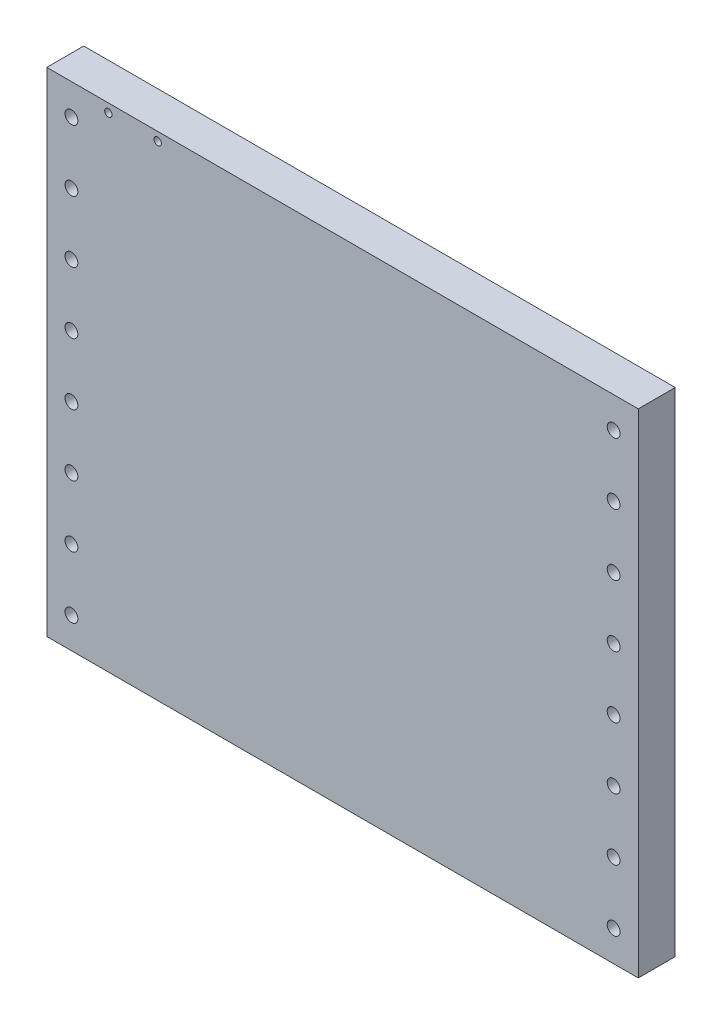
ISO-10303-21;
HEADER;
FILE_DESCRIPTION(('STEP AP214'),'2;1');
FILE_NAME('part.step','',(''),(''),'','','');
FILE_SCHEMA(('AUTOMOTIVE_DESIGN { 1 0 10303 214 1 1 1 1 }'));
ENDSEC;
DATA;
#1=APPLICATION_CONTEXT('core data for automotive mechanical design processes');
#2=APPLICATION_PROTOCOL_DEFINITION('international standard','automotive_design',2000,#1);
#3=PRODUCT_CONTEXT('',#1,'mechanical');
#4=PRODUCT('Part','Part','',(#3));
#5=PRODUCT_RELATED_PRODUCT_CATEGORY('part','',(#4));
#6=PRODUCT_DEFINITION_FORMATION('','',#4);
#7=PRODUCT_DEFINITION_CONTEXT('part definition',#1,'design');
#8=PRODUCT_DEFINITION('design','',#6,#7);
#9=PRODUCT_DEFINITION_SHAPE('','',#8);
#10=(LENGTH_UNIT() NAMED_UNIT(*) SI_UNIT(.MILLI.,.METRE.));
#11=(NAMED_UNIT(*) PLANE_ANGLE_UNIT() SI_UNIT($,.RADIAN.));
#12=(NAMED_UNIT(*) SI_UNIT($,.STERADIAN.) SOLID_ANGLE_UNIT());
#13=UNCERTAINTY_MEASURE_WITH_UNIT(LENGTH_MEASURE(1.E-05),#10,'distance_accuracy_value','');
#14=(GEOMETRIC_REPRESENTATION_CONTEXT(3) GLOBAL_UNCERTAINTY_ASSIGNED_CONTEXT((#13)) GLOBAL_UNIT_ASSIGNED_CONTEXT((#10,
#11,#12)) REPRESENTATION_CONTEXT('',''));
#15=CARTESIAN_POINT('',(0.,0.,0.));
#16=DIRECTION('',(0.,0.,1.));
#17=DIRECTION('',(1.,0.,0.));
#18=AXIS2_PLACEMENT_3D('',#15,#16,#17);
#19=CARTESIAN_POINT('',(120.,-100.,7.5));
#20=DIRECTION('',(-1.,0.,0.));
#21=DIRECTION('',(0.,0.,1.));
#22=AXIS2_PLACEMENT_3D('',#19,#20,#21);
#23=PLANE('',#22);
#24=DIRECTION('',(0.,1.,0.));
#25=VECTOR('',#24,1.);
#26=CARTESIAN_POINT('',(120.,-100.,-7.5));
#27=LINE('',#26,#25);
#28=CARTESIAN_POINT('',(120.,-100.,-7.5));
#29=VERTEX_POINT('',#28);
#30=CARTESIAN_POINT('',(120.,100.,-7.5));
#31=VERTEX_POINT('',#30);
#32=EDGE_CURVE('E101',#29,#31,#27,.T.);
#33=ORIENTED_EDGE('',*,*,#32,.T.);
#34=DIRECTION('',(0.,0.,-1.));
#35=VECTOR('',#34,1.);
#36=CARTESIAN_POINT('',(120.,100.,7.5));
#37=LINE('',#36,#35);
#38=CARTESIAN_POINT('',(120.,100.,7.5));
#39=VERTEX_POINT('',#38);
#40=EDGE_CURVE('E92',#39,#31,#37,.T.);
#41=ORIENTED_EDGE('',*,*,#40,.F.);
#42=DIRECTION('',(0.,1.,0.));
#43=VECTOR('',#42,1.);
#44=CARTESIAN_POINT('',(120.,-100.,7.5));
#45=LINE('',#44,#43);
#46=CARTESIAN_POINT('',(120.,-100.,7.5));
#47=VERTEX_POINT('',#46);
#48=EDGE_CURVE('E86',#47,#39,#45,.T.);
#49=ORIENTED_EDGE('',*,*,#48,.F.);
#50=DIRECTION('',(0.,0.,-1.));
#51=VECTOR('',#50,1.);
#52=CARTESIAN_POINT('',(120.,-100.,7.5));
#53=LINE('',#52,#51);
#54=EDGE_CURVE('E97',#47,#29,#53,.T.);
#55=ORIENTED_EDGE('',*,*,#54,.T.);
#56=EDGE_LOOP('',(#33,#41,#49,#55));
#57=FACE_BOUND('',#56,.T.);
#58=ADVANCED_FACE('F32',(#57),#23,.F.);
#59=CARTESIAN_POINT('',(-120.,100.,7.5));
#60=DIRECTION('',(0.,-1.,0.));
#61=DIRECTION('',(0.,0.,-1.));
#62=AXIS2_PLACEMENT_3D('',#59,#60,#61);
#63=PLANE('',#62);
#64=DIRECTION('',(-1.,0.,0.));
#65=VECTOR('',#64,1.);
#66=CARTESIAN_POINT('',(-120.,100.,-7.5));
#67=LINE('',#66,#65);
#68=CARTESIAN_POINT('',(-120.,100.,-7.5));
#69=VERTEX_POINT('',#68);
#70=EDGE_CURVE('E91',#31,#69,#67,.T.);
#71=ORIENTED_EDGE('',*,*,#70,.T.);
#72=DIRECTION('',(0.,0.,-1.));
#73=VECTOR('',#72,1.);
#74=CARTESIAN_POINT('',(-120.,100.,7.5));
#75=LINE('',#74,#73);
#76=CARTESIAN_POINT('',(-120.,100.,7.5));
#77=VERTEX_POINT('',#76);
#78=EDGE_CURVE('E89',#77,#69,#75,.T.);
#79=ORIENTED_EDGE('',*,*,#78,.F.);
#80=DIRECTION('',(-1.,0.,0.));
#81=VECTOR('',#80,1.);
#82=CARTESIAN_POINT('',(-120.,100.,7.5));
#83=LINE('',#82,#81);
#84=EDGE_CURVE('E80',#39,#77,#83,.T.);
#85=ORIENTED_EDGE('',*,*,#84,.F.);
#86=ORIENTED_EDGE('',*,*,#40,.T.);
#87=EDGE_LOOP('',(#71,#79,#85,#86));
#88=FACE_BOUND('',#87,.T.);
#89=ADVANCED_FACE('F90',(#88),#63,.F.);
#90=CARTESIAN_POINT('',(-120.,-100.,7.5));
#91=DIRECTION('',(1.,0.,0.));
#92=DIRECTION('',(0.,0.,-1.));
#93=AXIS2_PLACEMENT_3D('',#90,#91,#92);
#94=PLANE('',#93);
#95=DIRECTION('',(0.,-1.,0.));
#96=VECTOR('',#95,1.);
#97=CARTESIAN_POINT('',(-120.,-100.,-7.5));
#98=LINE('',#97,#96);
#99=CARTESIAN_POINT('',(-120.,-100.,-7.5));
#100=VERTEX_POINT('',#99);
#101=EDGE_CURVE('E66',#69,#100,#98,.T.);
#102=ORIENTED_EDGE('',*,*,#101,.T.);
#103=DIRECTION('',(0.,0.,-1.));
#104=VECTOR('',#103,1.);
#105=CARTESIAN_POINT('',(-120.,-100.,7.5));
#106=LINE('',#105,#104);
#107=CARTESIAN_POINT('',(-120.,-100.,7.5));
#108=VERTEX_POINT('',#107);
#109=EDGE_CURVE('E93',#108,#100,#106,.T.);
#110=ORIENTED_EDGE('',*,*,#109,.F.);
#111=DIRECTION('',(0.,-1.,0.));
#112=VECTOR('',#111,1.);
#113=CARTESIAN_POINT('',(-120.,-100.,7.5));
#114=LINE('',#113,#112);
#115=EDGE_CURVE('E84',#77,#108,#114,.T.);
#116=ORIENTED_EDGE('',*,*,#115,.F.);
#117=ORIENTED_EDGE('',*,*,#78,.T.);
#118=EDGE_LOOP('',(#102,#110,#116,#117));
#119=FACE_BOUND('',#118,.T.);
#120=ADVANCED_FACE('F95',(#119),#94,.F.);
#121=CARTESIAN_POINT('',(-120.,-100.,7.5));
#122=DIRECTION('',(0.,1.,0.));
#123=DIRECTION('',(0.,0.,1.));
#124=AXIS2_PLACEMENT_3D('',#121,#122,#123);
#125=PLANE('',#124);
#126=DIRECTION('',(1.,0.,0.));
#127=VECTOR('',#126,1.);
#128=CARTESIAN_POINT('',(-120.,-100.,-7.5));
#129=LINE('',#128,#127);
#130=EDGE_CURVE('E72',#100,#29,#129,.T.);
#131=ORIENTED_EDGE('',*,*,#130,.T.);
#132=ORIENTED_EDGE('',*,*,#54,.F.);
#133=DIRECTION('',(1.,0.,0.));
#134=VECTOR('',#133,1.);
#135=CARTESIAN_POINT('',(-120.,-100.,7.5));
#136=LINE('',#135,#134);
#137=EDGE_CURVE('E49',#108,#47,#136,.T.);
#138=ORIENTED_EDGE('',*,*,#137,.F.);
#139=ORIENTED_EDGE('',*,*,#109,.T.);
#140=EDGE_LOOP('',(#131,#132,#138,#139));
#141=FACE_BOUND('',#140,.T.);
#142=ADVANCED_FACE('F188',(#141),#125,.F.);
#143=CARTESIAN_POINT('',(0.,0.,7.5));
#144=DIRECTION('',(0.,0.,-1.));
#145=DIRECTION('',(-1.,0.,0.));
#146=AXIS2_PLACEMENT_3D('',#143,#144,#145);
#147=PLANE('',#146);
#148=CARTESIAN_POINT('',(-75.,96.5,7.5));
#149=DIRECTION('',(0.,0.,1.));
#150=DIRECTION('',(1.,0.,0.));
#151=AXIS2_PLACEMENT_3D('',#148,#149,#150);
#152=CIRCLE('',#151,1.5);
#153=CARTESIAN_POINT('',(-73.5,96.5,7.5));
#154=VERTEX_POINT('',#153);
#155=EDGE_CURVE('E454',#154,#154,#152,.T.);
#156=ORIENTED_EDGE('',*,*,#155,.F.);
#157=EDGE_LOOP('',(#156));
#158=FACE_BOUND('',#157,.T.);
#159=CARTESIAN_POINT('',(-95.,96.5,7.5));
#160=DIRECTION('',(0.,0.,1.));
#161=DIRECTION('',(1.,0.,0.));
#162=AXIS2_PLACEMENT_3D('',#159,#160,#161);
#163=CIRCLE('',#162,1.5);
#164=CARTESIAN_POINT('',(-93.5,96.5,7.5));
#165=VERTEX_POINT('',#164);
#166=EDGE_CURVE('E448',#165,#165,#163,.T.);
#167=ORIENTED_EDGE('',*,*,#166,.F.);
#168=EDGE_LOOP('',(#167));
#169=FACE_BOUND('',#168,.T.);
#170=CARTESIAN_POINT('',(-110.,62.5,7.5));
#171=DIRECTION('',(0.,0.,1.));
#172=DIRECTION('',(1.,0.,0.));
#173=AXIS2_PLACEMENT_3D('',#170,#171,#172);
#174=CIRCLE('',#173,2.6);
#175=CARTESIAN_POINT('',(-107.4,62.5,7.5));
#176=VERTEX_POINT('',#175);
#177=EDGE_CURVE('E441',#176,#176,#174,.T.);
#178=ORIENTED_EDGE('',*,*,#177,.F.);
#179=EDGE_LOOP('',(#178));
#180=FACE_BOUND('',#179,.T.);
#181=CARTESIAN_POINT('',(110.,62.5,7.5));
#182=DIRECTION('',(0.,0.,1.));
#183=DIRECTION('',(1.,0.,0.));
#184=AXIS2_PLACEMENT_3D('',#181,#182,#183);
#185=CIRCLE('',#184,2.6);
#186=CARTESIAN_POINT('',(112.6,62.5,7.5));
#187=VERTEX_POINT('',#186);
#188=EDGE_CURVE('E434',#187,#187,#185,.T.);
#189=ORIENTED_EDGE('',*,*,#188,.F.);
#190=EDGE_LOOP('',(#189));
#191=FACE_BOUND('',#190,.T.);
#192=CARTESIAN_POINT('',(110.,87.5,7.5));
#193=DIRECTION('',(0.,0.,1.));
#194=DIRECTION('',(1.,0.,0.));
#195=AXIS2_PLACEMENT_3D('',#192,#193,#194);
#196=CIRCLE('',#195,2.6);
#197=CARTESIAN_POINT('',(112.6,87.5,7.5));
#198=VERTEX_POINT('',#197);
#199=EDGE_CURVE('E430',#198,#198,#196,.T.);
#200=ORIENTED_EDGE('',*,*,#199,.F.);
#201=EDGE_LOOP('',(#200));
#202=FACE_BOUND('',#201,.T.);
#203=CARTESIAN_POINT('',(-110.,87.5,7.5));
#204=DIRECTION('',(0.,0.,1.));
#205=DIRECTION('',(1.,0.,0.));
#206=AXIS2_PLACEMENT_3D('',#203,#204,#205);
#207=CIRCLE('',#206,2.6);
#208=CARTESIAN_POINT('',(-107.4,87.5,7.5));
#209=VERTEX_POINT('',#208);
#210=EDGE_CURVE('E424',#209,#209,#207,.T.);
#211=ORIENTED_EDGE('',*,*,#210,.F.);
#212=EDGE_LOOP('',(#211));
#213=FACE_BOUND('',#212,.T.);
#214=ORIENTED_EDGE('',*,*,#48,.T.);
#215=ORIENTED_EDGE('',*,*,#84,.T.);
#216=ORIENTED_EDGE('',*,*,#115,.T.);
#217=ORIENTED_EDGE('',*,*,#137,.T.);
#218=EDGE_LOOP('',(#214,#215,#216,#217));
#219=FACE_BOUND('',#218,.T.);
#220=CARTESIAN_POINT('',(110.,37.5,7.5));
#221=DIRECTION('',(0.,0.,1.));
#222=DIRECTION('',(1.,0.,0.));
#223=AXIS2_PLACEMENT_3D('',#220,#221,#222);
#224=CIRCLE('',#223,2.6);
#225=CARTESIAN_POINT('',(112.6,37.5,7.5));
#226=VERTEX_POINT('',#225);
#227=EDGE_CURVE('E114',#226,#226,#224,.T.);
#228=ORIENTED_EDGE('',*,*,#227,.F.);
#229=EDGE_LOOP('',(#228));
#230=FACE_BOUND('',#229,.T.);
#231=CARTESIAN_POINT('',(110.,12.5,7.5));
#232=DIRECTION('',(0.,0.,1.));
#233=DIRECTION('',(1.,0.,0.));
#234=AXIS2_PLACEMENT_3D('',#231,#232,#233);
#235=CIRCLE('',#234,2.6);
#236=CARTESIAN_POINT('',(112.6,12.5,7.5));
#237=VERTEX_POINT('',#236);
#238=EDGE_CURVE('E120',#237,#237,#235,.T.);
#239=ORIENTED_EDGE('',*,*,#238,.F.);
#240=EDGE_LOOP('',(#239));
#241=FACE_BOUND('',#240,.T.);
#242=CARTESIAN_POINT('',(110.,-12.5,7.5));
#243=DIRECTION('',(0.,0.,1.));
#244=DIRECTION('',(1.,0.,0.));
#245=AXIS2_PLACEMENT_3D('',#242,#243,#244);
#246=CIRCLE('',#245,2.6);
#247=CARTESIAN_POINT('',(112.6,-12.5,7.5));
#248=VERTEX_POINT('',#247);
#249=EDGE_CURVE('E126',#248,#248,#246,.T.);
#250=ORIENTED_EDGE('',*,*,#249,.F.);
#251=EDGE_LOOP('',(#250));
#252=FACE_BOUND('',#251,.T.);
#253=CARTESIAN_POINT('',(110.,-37.5,7.5));
#254=DIRECTION('',(0.,0.,1.));
#255=DIRECTION('',(1.,0.,0.));
#256=AXIS2_PLACEMENT_3D('',#253,#254,#255);
#257=CIRCLE('',#256,2.6);
#258=CARTESIAN_POINT('',(112.6,-37.5,7.5));
#259=VERTEX_POINT('',#258);
#260=EDGE_CURVE('E132',#259,#259,#257,.T.);
#261=ORIENTED_EDGE('',*,*,#260,.F.);
#262=EDGE_LOOP('',(#261));
#263=FACE_BOUND('',#262,.T.);
#264=CARTESIAN_POINT('',(110.,-62.5000000000001,7.5));
#265=DIRECTION('',(0.,0.,1.));
#266=DIRECTION('',(1.,0.,0.));
#267=AXIS2_PLACEMENT_3D('',#264,#265,#266);
#268=CIRCLE('',#267,2.6);
#269=CARTESIAN_POINT('',(112.6,-62.5000000000001,7.5));
#270=VERTEX_POINT('',#269);
#271=EDGE_CURVE('E138',#270,#270,#268,.T.);
#272=ORIENTED_EDGE('',*,*,#271,.F.);
#273=EDGE_LOOP('',(#272));
#274=FACE_BOUND('',#273,.T.);
#275=CARTESIAN_POINT('',(110.,-87.5000000000001,7.5));
#276=DIRECTION('',(0.,0.,1.));
#277=DIRECTION('',(1.,0.,0.));
#278=AXIS2_PLACEMENT_3D('',#275,#276,#277);
#279=CIRCLE('',#278,2.6);
#280=CARTESIAN_POINT('',(112.6,-87.5000000000001,7.5));
#281=VERTEX_POINT('',#280);
#282=EDGE_CURVE('E144',#281,#281,#279,.T.);
#283=ORIENTED_EDGE('',*,*,#282,.F.);
#284=EDGE_LOOP('',(#283));
#285=FACE_BOUND('',#284,.T.);
#286=CARTESIAN_POINT('',(-110.,37.5,7.5));
#287=DIRECTION('',(0.,0.,1.));
#288=DIRECTION('',(1.,0.,0.));
#289=AXIS2_PLACEMENT_3D('',#286,#287,#288);
#290=CIRCLE('',#289,2.6);
#291=CARTESIAN_POINT('',(-107.4,37.5,7.5));
#292=VERTEX_POINT('',#291);
#293=EDGE_CURVE('E150',#292,#292,#290,.T.);
#294=ORIENTED_EDGE('',*,*,#293,.F.);
#295=EDGE_LOOP('',(#294));
#296=FACE_BOUND('',#295,.T.);
#297=CARTESIAN_POINT('',(-110.,12.5,7.5));
#298=DIRECTION('',(0.,0.,1.));
#299=DIRECTION('',(1.,0.,0.));
#300=AXIS2_PLACEMENT_3D('',#297,#298,#299);
#301=CIRCLE('',#300,2.6);
#302=CARTESIAN_POINT('',(-107.4,12.5,7.5));
#303=VERTEX_POINT('',#302);
#304=EDGE_CURVE('E156',#303,#303,#301,.T.);
#305=ORIENTED_EDGE('',*,*,#304,.F.);
#306=EDGE_LOOP('',(#305));
#307=FACE_BOUND('',#306,.T.);
#308=CARTESIAN_POINT('',(-110.,-12.5,7.5));
#309=DIRECTION('',(0.,0.,1.));
#310=DIRECTION('',(1.,0.,0.));
#311=AXIS2_PLACEMENT_3D('',#308,#309,#310);
#312=CIRCLE('',#311,2.6);
#313=CARTESIAN_POINT('',(-107.4,-12.5,7.5));
#314=VERTEX_POINT('',#313);
#315=EDGE_CURVE('E162',#314,#314,#312,.T.);
#316=ORIENTED_EDGE('',*,*,#315,.F.);
#317=EDGE_LOOP('',(#316));
#318=FACE_BOUND('',#317,.T.);
#319=CARTESIAN_POINT('',(-110.,-37.5,7.5));
#320=DIRECTION('',(0.,0.,1.));
#321=DIRECTION('',(1.,0.,0.));
#322=AXIS2_PLACEMENT_3D('',#319,#320,#321);
#323=CIRCLE('',#322,2.6);
#324=CARTESIAN_POINT('',(-107.4,-37.5,7.5));
#325=VERTEX_POINT('',#324);
#326=EDGE_CURVE('E168',#325,#325,#323,.T.);
#327=ORIENTED_EDGE('',*,*,#326,.F.);
#328=EDGE_LOOP('',(#327));
#329=FACE_BOUND('',#328,.T.);
#330=CARTESIAN_POINT('',(-110.,-62.5000000000001,7.5));
#331=DIRECTION('',(0.,0.,1.));
#332=DIRECTION('',(1.,0.,0.));
#333=AXIS2_PLACEMENT_3D('',#330,#331,#332);
#334=CIRCLE('',#333,2.6);
#335=CARTESIAN_POINT('',(-107.4,-62.5000000000001,7.5));
#336=VERTEX_POINT('',#335);
#337=EDGE_CURVE('E174',#336,#336,#334,.T.);
#338=ORIENTED_EDGE('',*,*,#337,.F.);
#339=EDGE_LOOP('',(#338));
#340=FACE_BOUND('',#339,.T.);
#341=CARTESIAN_POINT('',(-110.,-87.5000000000001,7.5));
#342=DIRECTION('',(0.,0.,1.));
#343=DIRECTION('',(1.,0.,0.));
#344=AXIS2_PLACEMENT_3D('',#341,#342,#343);
#345=CIRCLE('',#344,2.6);
#346=CARTESIAN_POINT('',(-107.4,-87.5000000000001,7.5));
#347=VERTEX_POINT('',#346);
#348=EDGE_CURVE('E11',#347,#347,#345,.T.);
#349=ORIENTED_EDGE('',*,*,#348,.F.);
#350=EDGE_LOOP('',(#349));
#351=FACE_BOUND('',#350,.T.);
#352=ADVANCED_FACE('F81',(#158,#169,#180,#191,#202,#213,#219,#230,#241,#252,#263,#274,#285,#296,
#307,#318,#329,#340,#351),#147,.F.);
#353=CARTESIAN_POINT('',(0.,0.,-7.5));
#354=DIRECTION('',(0.,0.,-1.));
#355=DIRECTION('',(-1.,0.,0.));
#356=AXIS2_PLACEMENT_3D('',#353,#354,#355);
#357=PLANE('',#356);
#358=CARTESIAN_POINT('',(-75.,96.5,-7.5));
#359=DIRECTION('',(0.,0.,1.));
#360=DIRECTION('',(1.,0.,0.));
#361=AXIS2_PLACEMENT_3D('',#358,#359,#360);
#362=CIRCLE('',#361,1.5);
#363=CARTESIAN_POINT('',(-73.5,96.5,-7.5));
#364=VERTEX_POINT('',#363);
#365=EDGE_CURVE('E451',#364,#364,#362,.T.);
#366=ORIENTED_EDGE('',*,*,#365,.T.);
#367=EDGE_LOOP('',(#366));
#368=FACE_BOUND('',#367,.T.);
#369=CARTESIAN_POINT('',(-95.,96.5,-7.5));
#370=DIRECTION('',(0.,0.,1.));
#371=DIRECTION('',(1.,0.,0.));
#372=AXIS2_PLACEMENT_3D('',#369,#370,#371);
#373=CIRCLE('',#372,1.5);
#374=CARTESIAN_POINT('',(-93.5,96.5,-7.5));
#375=VERTEX_POINT('',#374);
#376=EDGE_CURVE('E447',#375,#375,#373,.T.);
#377=ORIENTED_EDGE('',*,*,#376,.T.);
#378=EDGE_LOOP('',(#377));
#379=FACE_BOUND('',#378,.T.);
#380=CARTESIAN_POINT('',(-110.,62.5,-7.5));
#381=DIRECTION('',(0.,0.,1.));
#382=DIRECTION('',(1.,0.,0.));
#383=AXIS2_PLACEMENT_3D('',#380,#381,#382);
#384=CIRCLE('',#383,2.6);
#385=CARTESIAN_POINT('',(-107.4,62.5,-7.5));
#386=VERTEX_POINT('',#385);
#387=EDGE_CURVE('E444',#386,#386,#384,.T.);
#388=ORIENTED_EDGE('',*,*,#387,.T.);
#389=EDGE_LOOP('',(#388));
#390=FACE_BOUND('',#389,.T.);
#391=CARTESIAN_POINT('',(110.,62.5,-7.5));
#392=DIRECTION('',(0.,0.,1.));
#393=DIRECTION('',(1.,0.,0.));
#394=AXIS2_PLACEMENT_3D('',#391,#392,#393);
#395=CIRCLE('',#394,2.6);
#396=CARTESIAN_POINT('',(112.6,62.5,-7.5));
#397=VERTEX_POINT('',#396);
#398=EDGE_CURVE('E438',#397,#397,#395,.T.);
#399=ORIENTED_EDGE('',*,*,#398,.T.);
#400=EDGE_LOOP('',(#399));
#401=FACE_BOUND('',#400,.T.);
#402=CARTESIAN_POINT('',(110.,87.5,-7.5));
#403=DIRECTION('',(0.,0.,1.));
#404=DIRECTION('',(1.,0.,0.));
#405=AXIS2_PLACEMENT_3D('',#402,#403,#404);
#406=CIRCLE('',#405,2.6);
#407=CARTESIAN_POINT('',(112.6,87.5,-7.5));
#408=VERTEX_POINT('',#407);
#409=EDGE_CURVE('E426',#408,#408,#406,.T.);
#410=ORIENTED_EDGE('',*,*,#409,.T.);
#411=EDGE_LOOP('',(#410));
#412=FACE_BOUND('',#411,.T.);
#413=CARTESIAN_POINT('',(-110.,87.5,-7.5));
#414=DIRECTION('',(0.,0.,1.));
#415=DIRECTION('',(1.,0.,0.));
#416=AXIS2_PLACEMENT_3D('',#413,#414,#415);
#417=CIRCLE('',#416,2.6);
#418=CARTESIAN_POINT('',(-107.4,87.5,-7.5));
#419=VERTEX_POINT('',#418);
#420=EDGE_CURVE('E104',#419,#419,#417,.T.);
#421=ORIENTED_EDGE('',*,*,#420,.T.);
#422=EDGE_LOOP('',(#421));
#423=FACE_BOUND('',#422,.T.);
#424=ORIENTED_EDGE('',*,*,#32,.F.);
#425=ORIENTED_EDGE('',*,*,#130,.F.);
#426=ORIENTED_EDGE('',*,*,#101,.F.);
#427=ORIENTED_EDGE('',*,*,#70,.F.);
#428=EDGE_LOOP('',(#424,#425,#426,#427));
#429=FACE_BOUND('',#428,.T.);
#430=CARTESIAN_POINT('',(110.,37.5,-7.5));
#431=DIRECTION('',(0.,0.,1.));
#432=DIRECTION('',(1.,0.,0.));
#433=AXIS2_PLACEMENT_3D('',#430,#431,#432);
#434=CIRCLE('',#433,2.6);
#435=CARTESIAN_POINT('',(112.6,37.5,-7.5));
#436=VERTEX_POINT('',#435);
#437=EDGE_CURVE('E111',#436,#436,#434,.T.);
#438=ORIENTED_EDGE('',*,*,#437,.T.);
#439=EDGE_LOOP('',(#438));
#440=FACE_BOUND('',#439,.T.);
#441=CARTESIAN_POINT('',(110.,12.5,-7.5));
#442=DIRECTION('',(0.,0.,1.));
#443=DIRECTION('',(1.,0.,0.));
#444=AXIS2_PLACEMENT_3D('',#441,#442,#443);
#445=CIRCLE('',#444,2.6);
#446=CARTESIAN_POINT('',(112.6,12.5,-7.5));
#447=VERTEX_POINT('',#446);
#448=EDGE_CURVE('E117',#447,#447,#445,.T.);
#449=ORIENTED_EDGE('',*,*,#448,.T.);
#450=EDGE_LOOP('',(#449));
#451=FACE_BOUND('',#450,.T.);
#452=CARTESIAN_POINT('',(110.,-12.5,-7.5));
#453=DIRECTION('',(0.,0.,1.));
#454=DIRECTION('',(1.,0.,0.));
#455=AXIS2_PLACEMENT_3D('',#452,#453,#454);
#456=CIRCLE('',#455,2.6);
#457=CARTESIAN_POINT('',(112.6,-12.5,-7.5));
#458=VERTEX_POINT('',#457);
#459=EDGE_CURVE('E123',#458,#458,#456,.T.);
#460=ORIENTED_EDGE('',*,*,#459,.T.);
#461=EDGE_LOOP('',(#460));
#462=FACE_BOUND('',#461,.T.);
#463=CARTESIAN_POINT('',(110.,-37.5,-7.5));
#464=DIRECTION('',(0.,0.,1.));
#465=DIRECTION('',(1.,0.,0.));
#466=AXIS2_PLACEMENT_3D('',#463,#464,#465);
#467=CIRCLE('',#466,2.6);
#468=CARTESIAN_POINT('',(112.6,-37.5,-7.5));
#469=VERTEX_POINT('',#468);
#470=EDGE_CURVE('E129',#469,#469,#467,.T.);
#471=ORIENTED_EDGE('',*,*,#470,.T.);
#472=EDGE_LOOP('',(#471));
#473=FACE_BOUND('',#472,.T.);
#474=CARTESIAN_POINT('',(110.,-62.5000000000001,-7.5));
#475=DIRECTION('',(0.,0.,1.));
#476=DIRECTION('',(1.,0.,0.));
#477=AXIS2_PLACEMENT_3D('',#474,#475,#476);
#478=CIRCLE('',#477,2.6);
#479=CARTESIAN_POINT('',(112.6,-62.5000000000001,-7.5));
#480=VERTEX_POINT('',#479);
#481=EDGE_CURVE('E135',#480,#480,#478,.T.);
#482=ORIENTED_EDGE('',*,*,#481,.T.);
#483=EDGE_LOOP('',(#482));
#484=FACE_BOUND('',#483,.T.);
#485=CARTESIAN_POINT('',(110.,-87.5000000000001,-7.5));
#486=DIRECTION('',(0.,0.,1.));
#487=DIRECTION('',(1.,0.,0.));
#488=AXIS2_PLACEMENT_3D('',#485,#486,#487);
#489=CIRCLE('',#488,2.6);
#490=CARTESIAN_POINT('',(112.6,-87.5000000000001,-7.5));
#491=VERTEX_POINT('',#490);
#492=EDGE_CURVE('E141',#491,#491,#489,.T.);
#493=ORIENTED_EDGE('',*,*,#492,.T.);
#494=EDGE_LOOP('',(#493));
#495=FACE_BOUND('',#494,.T.);
#496=CARTESIAN_POINT('',(-110.,37.5,-7.5));
#497=DIRECTION('',(0.,0.,1.));
#498=DIRECTION('',(1.,0.,0.));
#499=AXIS2_PLACEMENT_3D('',#496,#497,#498);
#500=CIRCLE('',#499,2.6);
#501=CARTESIAN_POINT('',(-107.4,37.5,-7.5));
#502=VERTEX_POINT('',#501);
#503=EDGE_CURVE('E147',#502,#502,#500,.T.);
#504=ORIENTED_EDGE('',*,*,#503,.T.);
#505=EDGE_LOOP('',(#504));
#506=FACE_BOUND('',#505,.T.);
#507=CARTESIAN_POINT('',(-110.,12.5,-7.5));
#508=DIRECTION('',(0.,0.,1.));
#509=DIRECTION('',(1.,0.,0.));
#510=AXIS2_PLACEMENT_3D('',#507,#508,#509);
#511=CIRCLE('',#510,2.6);
#512=CARTESIAN_POINT('',(-107.4,12.5,-7.5));
#513=VERTEX_POINT('',#512);
#514=EDGE_CURVE('E153',#513,#513,#511,.T.);
#515=ORIENTED_EDGE('',*,*,#514,.T.);
#516=EDGE_LOOP('',(#515));
#517=FACE_BOUND('',#516,.T.);
#518=CARTESIAN_POINT('',(-110.,-12.5,-7.5));
#519=DIRECTION('',(0.,0.,1.));
#520=DIRECTION('',(1.,0.,0.));
#521=AXIS2_PLACEMENT_3D('',#518,#519,#520);
#522=CIRCLE('',#521,2.6);
#523=CARTESIAN_POINT('',(-107.4,-12.5,-7.5));
#524=VERTEX_POINT('',#523);
#525=EDGE_CURVE('E159',#524,#524,#522,.T.);
#526=ORIENTED_EDGE('',*,*,#525,.T.);
#527=EDGE_LOOP('',(#526));
#528=FACE_BOUND('',#527,.T.);
#529=CARTESIAN_POINT('',(-110.,-37.5,-7.5));
#530=DIRECTION('',(0.,0.,1.));
#531=DIRECTION('',(1.,0.,0.));
#532=AXIS2_PLACEMENT_3D('',#529,#530,#531);
#533=CIRCLE('',#532,2.6);
#534=CARTESIAN_POINT('',(-107.4,-37.5,-7.5));
#535=VERTEX_POINT('',#534);
#536=EDGE_CURVE('E165',#535,#535,#533,.T.);
#537=ORIENTED_EDGE('',*,*,#536,.T.);
#538=EDGE_LOOP('',(#537));
#539=FACE_BOUND('',#538,.T.);
#540=CARTESIAN_POINT('',(-110.,-62.5000000000001,-7.5));
#541=DIRECTION('',(0.,0.,1.));
#542=DIRECTION('',(1.,0.,0.));
#543=AXIS2_PLACEMENT_3D('',#540,#541,#542);
#544=CIRCLE('',#543,2.6);
#545=CARTESIAN_POINT('',(-107.4,-62.5000000000001,-7.5));
#546=VERTEX_POINT('',#545);
#547=EDGE_CURVE('E171',#546,#546,#544,.T.);
#548=ORIENTED_EDGE('',*,*,#547,.T.);
#549=EDGE_LOOP('',(#548));
#550=FACE_BOUND('',#549,.T.);
#551=CARTESIAN_POINT('',(-110.,-87.5000000000001,-7.5));
#552=DIRECTION('',(0.,0.,1.));
#553=DIRECTION('',(1.,0.,0.));
#554=AXIS2_PLACEMENT_3D('',#551,#552,#553);
#555=CIRCLE('',#554,2.6);
#556=CARTESIAN_POINT('',(-107.4,-87.5000000000001,-7.5));
#557=VERTEX_POINT('',#556);
#558=EDGE_CURVE('E41',#557,#557,#555,.T.);
#559=ORIENTED_EDGE('',*,*,#558,.T.);
#560=EDGE_LOOP('',(#559));
#561=FACE_BOUND('',#560,.T.);
#562=ADVANCED_FACE('F179',(#368,#379,#390,#401,#412,#423,#429,#440,#451,#462,#473,#484,#495,
#506,#517,#528,#539,#550,#561),#357,.T.);
#563=CARTESIAN_POINT('',(-110.,87.5,-7.5));
#564=DIRECTION('',(0.,0.,1.));
#565=DIRECTION('',(1.,0.,0.));
#566=AXIS2_PLACEMENT_3D('',#563,#564,#565);
#567=CYLINDRICAL_SURFACE('',#566,2.6);
#568=ORIENTED_EDGE('',*,*,#420,.F.);
#569=EDGE_LOOP('',(#568));
#570=FACE_BOUND('',#569,.T.);
#571=ORIENTED_EDGE('',*,*,#210,.T.);
#572=EDGE_LOOP('',(#571));
#573=FACE_BOUND('',#572,.T.);
#574=ADVANCED_FACE('F195',(#570,#573),#567,.F.);
#575=CARTESIAN_POINT('',(110.,87.5,-7.5));
#576=DIRECTION('',(0.,0.,1.));
#577=DIRECTION('',(1.,0.,0.));
#578=AXIS2_PLACEMENT_3D('',#575,#576,#577);
#579=CYLINDRICAL_SURFACE('',#578,2.6);
#580=ORIENTED_EDGE('',*,*,#409,.F.);
#581=EDGE_LOOP('',(#580));
#582=FACE_BOUND('',#581,.T.);
#583=ORIENTED_EDGE('',*,*,#199,.T.);
#584=EDGE_LOOP('',(#583));
#585=FACE_BOUND('',#584,.T.);
#586=ADVANCED_FACE('F356',(#582,#585),#579,.F.);
#587=CARTESIAN_POINT('',(110.,62.5,-7.5));
#588=DIRECTION('',(0.,0.,1.));
#589=DIRECTION('',(1.,0.,0.));
#590=AXIS2_PLACEMENT_3D('',#587,#588,#589);
#591=CYLINDRICAL_SURFACE('',#590,2.6);
#592=ORIENTED_EDGE('',*,*,#398,.F.);
#593=EDGE_LOOP('',(#592));
#594=FACE_BOUND('',#593,.T.);
#595=ORIENTED_EDGE('',*,*,#188,.T.);
#596=EDGE_LOOP('',(#595));
#597=FACE_BOUND('',#596,.T.);
#598=ADVANCED_FACE('F215',(#594,#597),#591,.F.);
#599=CARTESIAN_POINT('',(110.,37.5,-7.5));
#600=DIRECTION('',(0.,0.,1.));
#601=DIRECTION('',(1.,0.,0.));
#602=AXIS2_PLACEMENT_3D('',#599,#600,#601);
#603=CYLINDRICAL_SURFACE('',#602,2.6);
#604=ORIENTED_EDGE('',*,*,#437,.F.);
#605=EDGE_LOOP('',(#604));
#606=FACE_BOUND('',#605,.T.);
#607=ORIENTED_EDGE('',*,*,#227,.T.);
#608=EDGE_LOOP('',(#607));
#609=FACE_BOUND('',#608,.T.);
#610=ADVANCED_FACE('F211',(#606,#609),#603,.F.);
#611=CARTESIAN_POINT('',(110.,12.5,-7.5));
#612=DIRECTION('',(0.,0.,1.));
#613=DIRECTION('',(1.,0.,0.));
#614=AXIS2_PLACEMENT_3D('',#611,#612,#613);
#615=CYLINDRICAL_SURFACE('',#614,2.6);
#616=ORIENTED_EDGE('',*,*,#448,.F.);
#617=EDGE_LOOP('',(#616));
#618=FACE_BOUND('',#617,.T.);
#619=ORIENTED_EDGE('',*,*,#238,.T.);
#620=EDGE_LOOP('',(#619));
#621=FACE_BOUND('',#620,.T.);
#622=ADVANCED_FACE('F214',(#618,#621),#615,.F.);
#623=CARTESIAN_POINT('',(110.,-12.5,-7.5));
#624=DIRECTION('',(0.,0.,1.));
#625=DIRECTION('',(1.,0.,0.));
#626=AXIS2_PLACEMENT_3D('',#623,#624,#625);
#627=CYLINDRICAL_SURFACE('',#626,2.6);
#628=ORIENTED_EDGE('',*,*,#459,.F.);
#629=EDGE_LOOP('',(#628));
#630=FACE_BOUND('',#629,.T.);
#631=ORIENTED_EDGE('',*,*,#249,.T.);
#632=EDGE_LOOP('',(#631));
#633=FACE_BOUND('',#632,.T.);
#634=ADVANCED_FACE('F219',(#630,#633),#627,.F.);
#635=CARTESIAN_POINT('',(110.,-37.5,-7.5));
#636=DIRECTION('',(0.,0.,1.));
#637=DIRECTION('',(1.,0.,0.));
#638=AXIS2_PLACEMENT_3D('',#635,#636,#637);
#639=CYLINDRICAL_SURFACE('',#638,2.6);
#640=ORIENTED_EDGE('',*,*,#470,.F.);
#641=EDGE_LOOP('',(#640));
#642=FACE_BOUND('',#641,.T.);
#643=ORIENTED_EDGE('',*,*,#260,.T.);
#644=EDGE_LOOP('',(#643));
#645=FACE_BOUND('',#644,.T.);
#646=ADVANCED_FACE('F223',(#642,#645),#639,.F.);
#647=CARTESIAN_POINT('',(110.,-62.5000000000001,-7.5));
#648=DIRECTION('',(0.,0.,1.));
#649=DIRECTION('',(1.,0.,0.));
#650=AXIS2_PLACEMENT_3D('',#647,#648,#649);
#651=CYLINDRICAL_SURFACE('',#650,2.6);
#652=ORIENTED_EDGE('',*,*,#481,.F.);
#653=EDGE_LOOP('',(#652));
#654=FACE_BOUND('',#653,.T.);
#655=ORIENTED_EDGE('',*,*,#271,.T.);
#656=EDGE_LOOP('',(#655));
#657=FACE_BOUND('',#656,.T.);
#658=ADVANCED_FACE('F227',(#654,#657),#651,.F.);
#659=CARTESIAN_POINT('',(110.,-87.5000000000001,-7.5));
#660=DIRECTION('',(0.,0.,1.));
#661=DIRECTION('',(1.,0.,0.));
#662=AXIS2_PLACEMENT_3D('',#659,#660,#661);
#663=CYLINDRICAL_SURFACE('',#662,2.6);
#664=ORIENTED_EDGE('',*,*,#492,.F.);
#665=EDGE_LOOP('',(#664));
#666=FACE_BOUND('',#665,.T.);
#667=ORIENTED_EDGE('',*,*,#282,.T.);
#668=EDGE_LOOP('',(#667));
#669=FACE_BOUND('',#668,.T.);
#670=ADVANCED_FACE('F231',(#666,#669),#663,.F.);
#671=CARTESIAN_POINT('',(-110.,62.5,-7.5));
#672=DIRECTION('',(0.,0.,1.));
#673=DIRECTION('',(1.,0.,0.));
#674=AXIS2_PLACEMENT_3D('',#671,#672,#673);
#675=CYLINDRICAL_SURFACE('',#674,2.6);
#676=ORIENTED_EDGE('',*,*,#387,.F.);
#677=EDGE_LOOP('',(#676));
#678=FACE_BOUND('',#677,.T.);
#679=ORIENTED_EDGE('',*,*,#177,.T.);
#680=EDGE_LOOP('',(#679));
#681=FACE_BOUND('',#680,.T.);
#682=ADVANCED_FACE('F235',(#678,#681),#675,.F.);
#683=CARTESIAN_POINT('',(-110.,37.5,-7.5));
#684=DIRECTION('',(0.,0.,1.));
#685=DIRECTION('',(1.,0.,0.));
#686=AXIS2_PLACEMENT_3D('',#683,#684,#685);
#687=CYLINDRICAL_SURFACE('',#686,2.6);
#688=ORIENTED_EDGE('',*,*,#503,.F.);
#689=EDGE_LOOP('',(#688));
#690=FACE_BOUND('',#689,.T.);
#691=ORIENTED_EDGE('',*,*,#293,.T.);
#692=EDGE_LOOP('',(#691));
#693=FACE_BOUND('',#692,.T.);
#694=ADVANCED_FACE('F237',(#690,#693),#687,.F.);
#695=CARTESIAN_POINT('',(-110.,12.5,-7.5));
#696=DIRECTION('',(0.,0.,1.));
#697=DIRECTION('',(1.,0.,0.));
#698=AXIS2_PLACEMENT_3D('',#695,#696,#697);
#699=CYLINDRICAL_SURFACE('',#698,2.6);
#700=ORIENTED_EDGE('',*,*,#514,.F.);
#701=EDGE_LOOP('',(#700));
#702=FACE_BOUND('',#701,.T.);
#703=ORIENTED_EDGE('',*,*,#304,.T.);
#704=EDGE_LOOP('',(#703));
#705=FACE_BOUND('',#704,.T.);
#706=ADVANCED_FACE('F240',(#702,#705),#699,.F.);
#707=CARTESIAN_POINT('',(-110.,-12.5,-7.5));
#708=DIRECTION('',(0.,0.,1.));
#709=DIRECTION('',(1.,0.,0.));
#710=AXIS2_PLACEMENT_3D('',#707,#708,#709);
#711=CYLINDRICAL_SURFACE('',#710,2.6);
#712=ORIENTED_EDGE('',*,*,#525,.F.);
#713=EDGE_LOOP('',(#712));
#714=FACE_BOUND('',#713,.T.);
#715=ORIENTED_EDGE('',*,*,#315,.T.);
#716=EDGE_LOOP('',(#715));
#717=FACE_BOUND('',#716,.T.);
#718=ADVANCED_FACE('F244',(#714,#717),#711,.F.);
#719=CARTESIAN_POINT('',(-110.,-37.5,-7.5));
#720=DIRECTION('',(0.,0.,1.));
#721=DIRECTION('',(1.,0.,0.));
#722=AXIS2_PLACEMENT_3D('',#719,#720,#721);
#723=CYLINDRICAL_SURFACE('',#722,2.6);
#724=ORIENTED_EDGE('',*,*,#536,.F.);
#725=EDGE_LOOP('',(#724));
#726=FACE_BOUND('',#725,.T.);
#727=ORIENTED_EDGE('',*,*,#326,.T.);
#728=EDGE_LOOP('',(#727));
#729=FACE_BOUND('',#728,.T.);
#730=ADVANCED_FACE('F248',(#726,#729),#723,.F.);
#731=CARTESIAN_POINT('',(-110.,-62.5000000000001,-7.5));
#732=DIRECTION('',(0.,0.,1.));
#733=DIRECTION('',(1.,0.,0.));
#734=AXIS2_PLACEMENT_3D('',#731,#732,#733);
#735=CYLINDRICAL_SURFACE('',#734,2.6);
#736=ORIENTED_EDGE('',*,*,#547,.F.);
#737=EDGE_LOOP('',(#736));
#738=FACE_BOUND('',#737,.T.);
#739=ORIENTED_EDGE('',*,*,#337,.T.);
#740=EDGE_LOOP('',(#739));
#741=FACE_BOUND('',#740,.T.);
#742=ADVANCED_FACE('F184',(#738,#741),#735,.F.);
#743=CARTESIAN_POINT('',(-110.,-87.5000000000001,-7.5));
#744=DIRECTION('',(0.,0.,1.));
#745=DIRECTION('',(1.,0.,0.));
#746=AXIS2_PLACEMENT_3D('',#743,#744,#745);
#747=CYLINDRICAL_SURFACE('',#746,2.6);
#748=ORIENTED_EDGE('',*,*,#558,.F.);
#749=EDGE_LOOP('',(#748));
#750=FACE_BOUND('',#749,.T.);
#751=ORIENTED_EDGE('',*,*,#348,.T.);
#752=EDGE_LOOP('',(#751));
#753=FACE_BOUND('',#752,.T.);
#754=ADVANCED_FACE('F34',(#750,#753),#747,.F.);
#755=CARTESIAN_POINT('',(-95.,96.5,-7.5));
#756=DIRECTION('',(0.,0.,1.));
#757=DIRECTION('',(1.,0.,0.));
#758=AXIS2_PLACEMENT_3D('',#755,#756,#757);
#759=CYLINDRICAL_SURFACE('',#758,1.5);
#760=ORIENTED_EDGE('',*,*,#376,.F.);
#761=EDGE_LOOP('',(#760));
#762=FACE_BOUND('',#761,.T.);
#763=ORIENTED_EDGE('',*,*,#166,.T.);
#764=EDGE_LOOP('',(#763));
#765=FACE_BOUND('',#764,.T.);
#766=ADVANCED_FACE('F183',(#762,#765),#759,.F.);
#767=CARTESIAN_POINT('',(-75.,96.5,-7.5));
#768=DIRECTION('',(0.,0.,1.));
#769=DIRECTION('',(1.,0.,0.));
#770=AXIS2_PLACEMENT_3D('',#767,#768,#769);
#771=CYLINDRICAL_SURFACE('',#770,1.5);
#772=ORIENTED_EDGE('',*,*,#365,.F.);
#773=EDGE_LOOP('',(#772));
#774=FACE_BOUND('',#773,.T.);
#775=ORIENTED_EDGE('',*,*,#155,.T.);
#776=EDGE_LOOP('',(#775));
#777=FACE_BOUND('',#776,.T.);
#778=ADVANCED_FACE('F273',(#774,#777),#771,.F.);
#779=CLOSED_SHELL('',(#58,#89,#120,#142,#352,#562,#574,#586,#598,#610,#622,#634,#646,#658,#670,
#682,#694,#706,#718,#730,#742,#754,#766,#778));
#780=MANIFOLD_SOLID_BREP('B2',#779);
#781=ADVANCED_BREP_SHAPE_REPRESENTATION('',(#18,#780),#14);
#782=SHAPE_DEFINITION_REPRESENTATION(#9,#781);
ENDSEC;
END-ISO-10303-21;
